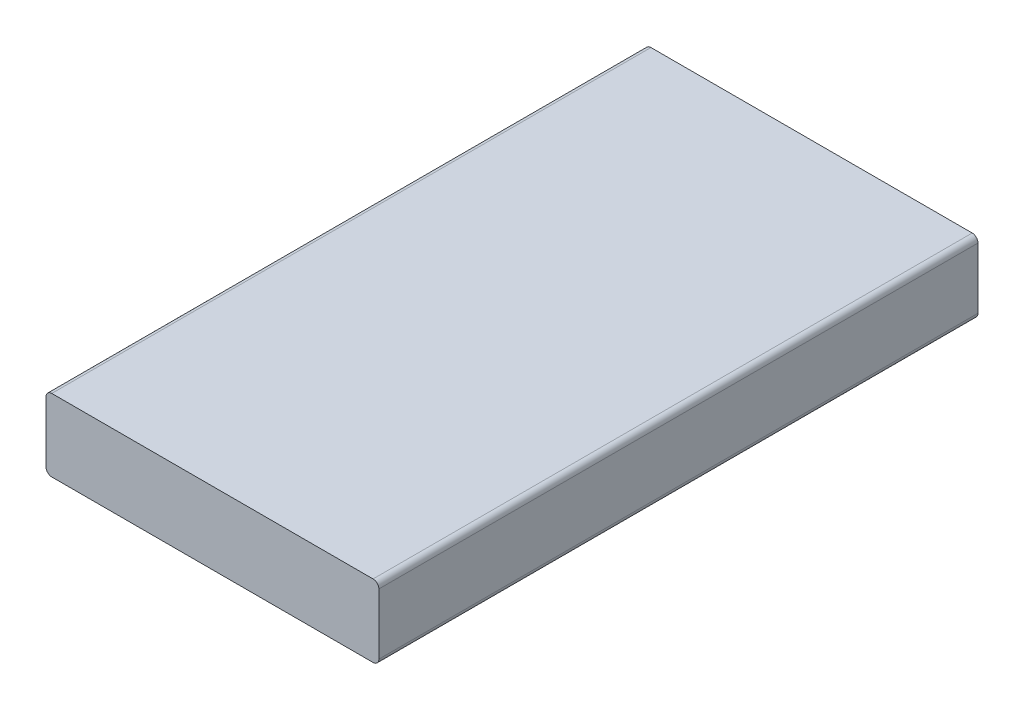
ISO-10303-21;
HEADER;
FILE_DESCRIPTION(('STEP AP214'),'2;1');
FILE_NAME('part.step','',(''),(''),'','','');
FILE_SCHEMA(('AUTOMOTIVE_DESIGN { 1 0 10303 214 1 1 1 1 }'));
ENDSEC;
DATA;
#1=APPLICATION_CONTEXT('core data for automotive mechanical design processes');
#2=APPLICATION_PROTOCOL_DEFINITION('international standard','automotive_design',2000,#1);
#3=PRODUCT_CONTEXT('',#1,'mechanical');
#4=PRODUCT('Part','Part','',(#3));
#5=PRODUCT_RELATED_PRODUCT_CATEGORY('part','',(#4));
#6=PRODUCT_DEFINITION_FORMATION('','',#4);
#7=PRODUCT_DEFINITION_CONTEXT('part definition',#1,'design');
#8=PRODUCT_DEFINITION('design','',#6,#7);
#9=PRODUCT_DEFINITION_SHAPE('','',#8);
#10=(LENGTH_UNIT() NAMED_UNIT(*) SI_UNIT(.MILLI.,.METRE.));
#11=(NAMED_UNIT(*) PLANE_ANGLE_UNIT() SI_UNIT($,.RADIAN.));
#12=(NAMED_UNIT(*) SI_UNIT($,.STERADIAN.) SOLID_ANGLE_UNIT());
#13=UNCERTAINTY_MEASURE_WITH_UNIT(LENGTH_MEASURE(1.E-05),#10,'distance_accuracy_value','');
#14=(GEOMETRIC_REPRESENTATION_CONTEXT(3) GLOBAL_UNCERTAINTY_ASSIGNED_CONTEXT((#13)) GLOBAL_UNIT_ASSIGNED_CONTEXT((#10,
#11,#12)) REPRESENTATION_CONTEXT('',''));
#15=CARTESIAN_POINT('',(0.,0.,0.));
#16=DIRECTION('',(0.,0.,1.));
#17=DIRECTION('',(1.,0.,0.));
#18=AXIS2_PLACEMENT_3D('',#15,#16,#17);
#19=CARTESIAN_POINT('',(-29.3402777777778,15.8854166666667,-207.));
#20=DIRECTION('',(-1.,0.,0.));
#21=DIRECTION('',(0.,0.,1.));
#22=AXIS2_PLACEMENT_3D('',#19,#20,#21);
#23=PLANE('',#22);
#24=DIRECTION('',(0.,-1.,0.));
#25=VECTOR('',#24,1.);
#26=CARTESIAN_POINT('',(-29.3402777777778,15.8854166666667,-207.));
#27=LINE('',#26,#25);
#28=CARTESIAN_POINT('',(-29.3402777777778,13.8854166666667,-207.));
#29=VERTEX_POINT('',#28);
#30=CARTESIAN_POINT('',(-29.3402777777778,-7.11458333333333,-207.));
#31=VERTEX_POINT('',#30);
#32=EDGE_CURVE('E179',#29,#31,#27,.T.);
#33=ORIENTED_EDGE('',*,*,#32,.T.);
#34=DIRECTION('',(0.,0.,1.));
#35=VECTOR('',#34,1.);
#36=CARTESIAN_POINT('',(-29.3402777777778,-7.11458333333333,-207.));
#37=LINE('',#36,#35);
#38=CARTESIAN_POINT('',(-29.3402777777778,-7.11458333333333,0.));
#39=VERTEX_POINT('',#38);
#40=EDGE_CURVE('E11',#31,#39,#37,.T.);
#41=ORIENTED_EDGE('',*,*,#40,.T.);
#42=DIRECTION('',(0.,-1.,0.));
#43=VECTOR('',#42,1.);
#44=CARTESIAN_POINT('',(-29.3402777777778,15.8854166666667,0.));
#45=LINE('',#44,#43);
#46=CARTESIAN_POINT('',(-29.3402777777778,13.8854166666667,0.));
#47=VERTEX_POINT('',#46);
#48=EDGE_CURVE('E112',#47,#39,#45,.T.);
#49=ORIENTED_EDGE('',*,*,#48,.F.);
#50=DIRECTION('',(0.,0.,1.));
#51=VECTOR('',#50,1.);
#52=CARTESIAN_POINT('',(-29.3402777777778,13.8854166666667,-207.));
#53=LINE('',#52,#51);
#54=EDGE_CURVE('E48',#47,#29,#53,.F.);
#55=ORIENTED_EDGE('',*,*,#54,.T.);
#56=EDGE_LOOP('',(#33,#41,#49,#55));
#57=FACE_BOUND('',#56,.T.);
#58=ADVANCED_FACE('F39',(#57),#23,.T.);
#59=CARTESIAN_POINT('',(-29.3402777777778,15.8854166666667,-207.));
#60=DIRECTION('',(0.,1.,0.));
#61=DIRECTION('',(0.,0.,1.));
#62=AXIS2_PLACEMENT_3D('',#59,#60,#61);
#63=PLANE('',#62);
#64=DIRECTION('',(-1.,0.,0.));
#65=VECTOR('',#64,1.);
#66=CARTESIAN_POINT('',(-29.3402777777778,15.8854166666667,0.));
#67=LINE('',#66,#65);
#68=CARTESIAN_POINT('',(83.6597222222222,15.8854166666667,0.));
#69=VERTEX_POINT('',#68);
#70=CARTESIAN_POINT('',(-27.3402777777778,15.8854166666667,0.));
#71=VERTEX_POINT('',#70);
#72=EDGE_CURVE('E143',#69,#71,#67,.T.);
#73=ORIENTED_EDGE('',*,*,#72,.F.);
#74=DIRECTION('',(0.,0.,1.));
#75=VECTOR('',#74,1.);
#76=CARTESIAN_POINT('',(83.6597222222222,15.8854166666667,-207.));
#77=LINE('',#76,#75);
#78=CARTESIAN_POINT('',(83.6597222222222,15.8854166666667,-207.));
#79=VERTEX_POINT('',#78);
#80=EDGE_CURVE('E62',#69,#79,#77,.F.);
#81=ORIENTED_EDGE('',*,*,#80,.T.);
#82=DIRECTION('',(-1.,0.,0.));
#83=VECTOR('',#82,1.);
#84=CARTESIAN_POINT('',(-29.3402777777778,15.8854166666667,-207.));
#85=LINE('',#84,#83);
#86=CARTESIAN_POINT('',(-27.3402777777778,15.8854166666667,-207.));
#87=VERTEX_POINT('',#86);
#88=EDGE_CURVE('E135',#79,#87,#85,.T.);
#89=ORIENTED_EDGE('',*,*,#88,.T.);
#90=DIRECTION('',(0.,0.,1.));
#91=VECTOR('',#90,1.);
#92=CARTESIAN_POINT('',(-27.3402777777778,15.8854166666667,-207.));
#93=LINE('',#92,#91);
#94=EDGE_CURVE('E170',#87,#71,#93,.T.);
#95=ORIENTED_EDGE('',*,*,#94,.T.);
#96=EDGE_LOOP('',(#73,#81,#89,#95));
#97=FACE_BOUND('',#96,.T.);
#98=ADVANCED_FACE('F188',(#97),#63,.T.);
#99=CARTESIAN_POINT('',(85.6597222222222,15.8854166666667,-207.));
#100=DIRECTION('',(1.,0.,0.));
#101=DIRECTION('',(0.,0.,-1.));
#102=AXIS2_PLACEMENT_3D('',#99,#100,#101);
#103=PLANE('',#102);
#104=DIRECTION('',(0.,1.,0.));
#105=VECTOR('',#104,1.);
#106=CARTESIAN_POINT('',(85.6597222222222,15.8854166666667,0.));
#107=LINE('',#106,#105);
#108=CARTESIAN_POINT('',(85.6597222222222,-7.11458333333333,0.));
#109=VERTEX_POINT('',#108);
#110=CARTESIAN_POINT('',(85.6597222222222,13.8854166666667,0.));
#111=VERTEX_POINT('',#110);
#112=EDGE_CURVE('E129',#109,#111,#107,.T.);
#113=ORIENTED_EDGE('',*,*,#112,.F.);
#114=DIRECTION('',(0.,0.,1.));
#115=VECTOR('',#114,1.);
#116=CARTESIAN_POINT('',(85.6597222222222,-7.11458333333333,-207.));
#117=LINE('',#116,#115);
#118=CARTESIAN_POINT('',(85.6597222222222,-7.11458333333333,-207.));
#119=VERTEX_POINT('',#118);
#120=EDGE_CURVE('E157',#109,#119,#117,.F.);
#121=ORIENTED_EDGE('',*,*,#120,.T.);
#122=DIRECTION('',(0.,1.,0.));
#123=VECTOR('',#122,1.);
#124=CARTESIAN_POINT('',(85.6597222222222,15.8854166666667,-207.));
#125=LINE('',#124,#123);
#126=CARTESIAN_POINT('',(85.6597222222222,13.8854166666667,-207.));
#127=VERTEX_POINT('',#126);
#128=EDGE_CURVE('E140',#119,#127,#125,.T.);
#129=ORIENTED_EDGE('',*,*,#128,.T.);
#130=DIRECTION('',(0.,0.,1.));
#131=VECTOR('',#130,1.);
#132=CARTESIAN_POINT('',(85.6597222222222,13.8854166666667,-207.));
#133=LINE('',#132,#131);
#134=EDGE_CURVE('E153',#127,#111,#133,.T.);
#135=ORIENTED_EDGE('',*,*,#134,.T.);
#136=EDGE_LOOP('',(#113,#121,#129,#135));
#137=FACE_BOUND('',#136,.T.);
#138=ADVANCED_FACE('F205',(#137),#103,.T.);
#139=CARTESIAN_POINT('',(-29.3402777777778,-9.11458333333333,-207.));
#140=DIRECTION('',(0.,-1.,0.));
#141=DIRECTION('',(0.,0.,-1.));
#142=AXIS2_PLACEMENT_3D('',#139,#140,#141);
#143=PLANE('',#142);
#144=DIRECTION('',(1.,0.,0.));
#145=VECTOR('',#144,1.);
#146=CARTESIAN_POINT('',(-29.3402777777778,-9.11458333333333,-207.));
#147=LINE('',#146,#145);
#148=CARTESIAN_POINT('',(-27.3402777777778,-9.11458333333333,-207.));
#149=VERTEX_POINT('',#148);
#150=CARTESIAN_POINT('',(83.6597222222222,-9.11458333333333,-207.));
#151=VERTEX_POINT('',#150);
#152=EDGE_CURVE('E184',#149,#151,#147,.T.);
#153=ORIENTED_EDGE('',*,*,#152,.T.);
#154=DIRECTION('',(0.,0.,1.));
#155=VECTOR('',#154,1.);
#156=CARTESIAN_POINT('',(83.6597222222222,-9.11458333333333,-207.));
#157=LINE('',#156,#155);
#158=CARTESIAN_POINT('',(83.6597222222222,-9.11458333333333,0.));
#159=VERTEX_POINT('',#158);
#160=EDGE_CURVE('E127',#151,#159,#157,.T.);
#161=ORIENTED_EDGE('',*,*,#160,.T.);
#162=DIRECTION('',(1.,0.,0.));
#163=VECTOR('',#162,1.);
#164=CARTESIAN_POINT('',(-29.3402777777778,-9.11458333333333,0.));
#165=LINE('',#164,#163);
#166=CARTESIAN_POINT('',(-27.3402777777778,-9.11458333333333,0.));
#167=VERTEX_POINT('',#166);
#168=EDGE_CURVE('E110',#167,#159,#165,.T.);
#169=ORIENTED_EDGE('',*,*,#168,.F.);
#170=DIRECTION('',(0.,0.,1.));
#171=VECTOR('',#170,1.);
#172=CARTESIAN_POINT('',(-27.3402777777778,-9.11458333333333,-207.));
#173=LINE('',#172,#171);
#174=EDGE_CURVE('E124',#167,#149,#173,.F.);
#175=ORIENTED_EDGE('',*,*,#174,.T.);
#176=EDGE_LOOP('',(#153,#161,#169,#175));
#177=FACE_BOUND('',#176,.T.);
#178=ADVANCED_FACE('F123',(#177),#143,.T.);
#179=CARTESIAN_POINT('',(0.,0.,-207.));
#180=DIRECTION('',(0.,0.,1.));
#181=DIRECTION('',(1.,0.,0.));
#182=AXIS2_PLACEMENT_3D('',#179,#180,#181);
#183=PLANE('',#182);
#184=ORIENTED_EDGE('',*,*,#128,.F.);
#185=CARTESIAN_POINT('',(83.6597222222222,-7.11458333333333,-207.));
#186=DIRECTION('',(0.,0.,1.));
#187=DIRECTION('',(1.,0.,0.));
#188=AXIS2_PLACEMENT_3D('',#185,#186,#187);
#189=CIRCLE('',#188,2.);
#190=EDGE_CURVE('E167',#119,#151,#189,.F.);
#191=ORIENTED_EDGE('',*,*,#190,.T.);
#192=ORIENTED_EDGE('',*,*,#152,.F.);
#193=CARTESIAN_POINT('',(-27.3402777777778,-7.11458333333333,-207.));
#194=DIRECTION('',(0.,0.,1.));
#195=DIRECTION('',(1.,0.,0.));
#196=AXIS2_PLACEMENT_3D('',#193,#194,#195);
#197=CIRCLE('',#196,2.);
#198=EDGE_CURVE('E133',#149,#31,#197,.F.);
#199=ORIENTED_EDGE('',*,*,#198,.T.);
#200=ORIENTED_EDGE('',*,*,#32,.F.);
#201=CARTESIAN_POINT('',(-27.3402777777778,13.8854166666667,-207.));
#202=DIRECTION('',(0.,0.,1.));
#203=DIRECTION('',(1.,0.,0.));
#204=AXIS2_PLACEMENT_3D('',#201,#202,#203);
#205=CIRCLE('',#204,2.);
#206=EDGE_CURVE('E55',#29,#87,#205,.F.);
#207=ORIENTED_EDGE('',*,*,#206,.T.);
#208=ORIENTED_EDGE('',*,*,#88,.F.);
#209=CARTESIAN_POINT('',(83.6597222222222,13.8854166666667,-207.));
#210=DIRECTION('',(0.,0.,1.));
#211=DIRECTION('',(1.,0.,0.));
#212=AXIS2_PLACEMENT_3D('',#209,#210,#211);
#213=CIRCLE('',#212,2.);
#214=EDGE_CURVE('E164',#79,#127,#213,.F.);
#215=ORIENTED_EDGE('',*,*,#214,.T.);
#216=EDGE_LOOP('',(#184,#191,#192,#199,#200,#207,#208,#215));
#217=FACE_BOUND('',#216,.T.);
#218=ADVANCED_FACE('F182',(#217),#183,.F.);
#219=CARTESIAN_POINT('',(0.,0.,0.));
#220=DIRECTION('',(0.,0.,1.));
#221=DIRECTION('',(1.,0.,0.));
#222=AXIS2_PLACEMENT_3D('',#219,#220,#221);
#223=PLANE('',#222);
#224=ORIENTED_EDGE('',*,*,#168,.T.);
#225=CARTESIAN_POINT('',(83.6597222222222,-7.11458333333333,0.));
#226=DIRECTION('',(0.,0.,1.));
#227=DIRECTION('',(1.,0.,0.));
#228=AXIS2_PLACEMENT_3D('',#225,#226,#227);
#229=CIRCLE('',#228,2.);
#230=EDGE_CURVE('E150',#159,#109,#229,.T.);
#231=ORIENTED_EDGE('',*,*,#230,.T.);
#232=ORIENTED_EDGE('',*,*,#112,.T.);
#233=CARTESIAN_POINT('',(83.6597222222222,13.8854166666667,0.));
#234=DIRECTION('',(0.,0.,1.));
#235=DIRECTION('',(1.,0.,0.));
#236=AXIS2_PLACEMENT_3D('',#233,#234,#235);
#237=CIRCLE('',#236,2.);
#238=EDGE_CURVE('E117',#111,#69,#237,.T.);
#239=ORIENTED_EDGE('',*,*,#238,.T.);
#240=ORIENTED_EDGE('',*,*,#72,.T.);
#241=CARTESIAN_POINT('',(-27.3402777777778,13.8854166666667,0.));
#242=DIRECTION('',(0.,0.,1.));
#243=DIRECTION('',(1.,0.,0.));
#244=AXIS2_PLACEMENT_3D('',#241,#242,#243);
#245=CIRCLE('',#244,2.);
#246=EDGE_CURVE('E118',#71,#47,#245,.T.);
#247=ORIENTED_EDGE('',*,*,#246,.T.);
#248=ORIENTED_EDGE('',*,*,#48,.T.);
#249=CARTESIAN_POINT('',(-27.3402777777778,-7.11458333333333,0.));
#250=DIRECTION('',(0.,0.,1.));
#251=DIRECTION('',(1.,0.,0.));
#252=AXIS2_PLACEMENT_3D('',#249,#250,#251);
#253=CIRCLE('',#252,2.);
#254=EDGE_CURVE('E107',#39,#167,#253,.T.);
#255=ORIENTED_EDGE('',*,*,#254,.T.);
#256=EDGE_LOOP('',(#224,#231,#232,#239,#240,#247,#248,#255));
#257=FACE_BOUND('',#256,.T.);
#258=ADVANCED_FACE('F109',(#257),#223,.T.);
#259=CARTESIAN_POINT('',(83.6597222222222,-7.11458333333333,-207.));
#260=DIRECTION('',(0.,0.,1.));
#261=DIRECTION('',(1.,0.,0.));
#262=AXIS2_PLACEMENT_3D('',#259,#260,#261);
#263=CYLINDRICAL_SURFACE('',#262,2.);
#264=ORIENTED_EDGE('',*,*,#190,.F.);
#265=ORIENTED_EDGE('',*,*,#120,.F.);
#266=ORIENTED_EDGE('',*,*,#230,.F.);
#267=ORIENTED_EDGE('',*,*,#160,.F.);
#268=EDGE_LOOP('',(#264,#265,#266,#267));
#269=FACE_BOUND('',#268,.T.);
#270=ADVANCED_FACE('F202',(#269),#263,.T.);
#271=CARTESIAN_POINT('',(83.6597222222222,13.8854166666667,-207.));
#272=DIRECTION('',(0.,0.,1.));
#273=DIRECTION('',(1.,0.,0.));
#274=AXIS2_PLACEMENT_3D('',#271,#272,#273);
#275=CYLINDRICAL_SURFACE('',#274,2.);
#276=ORIENTED_EDGE('',*,*,#214,.F.);
#277=ORIENTED_EDGE('',*,*,#80,.F.);
#278=ORIENTED_EDGE('',*,*,#238,.F.);
#279=ORIENTED_EDGE('',*,*,#134,.F.);
#280=EDGE_LOOP('',(#276,#277,#278,#279));
#281=FACE_BOUND('',#280,.T.);
#282=ADVANCED_FACE('F209',(#281),#275,.T.);
#283=CARTESIAN_POINT('',(-27.3402777777778,-7.11458333333333,-207.));
#284=DIRECTION('',(0.,0.,1.));
#285=DIRECTION('',(1.,0.,0.));
#286=AXIS2_PLACEMENT_3D('',#283,#284,#285);
#287=CYLINDRICAL_SURFACE('',#286,2.);
#288=ORIENTED_EDGE('',*,*,#198,.F.);
#289=ORIENTED_EDGE('',*,*,#174,.F.);
#290=ORIENTED_EDGE('',*,*,#254,.F.);
#291=ORIENTED_EDGE('',*,*,#40,.F.);
#292=EDGE_LOOP('',(#288,#289,#290,#291));
#293=FACE_BOUND('',#292,.T.);
#294=ADVANCED_FACE('F132',(#293),#287,.T.);
#295=CARTESIAN_POINT('',(-27.3402777777778,13.8854166666667,-207.));
#296=DIRECTION('',(0.,0.,1.));
#297=DIRECTION('',(1.,0.,0.));
#298=AXIS2_PLACEMENT_3D('',#295,#296,#297);
#299=CYLINDRICAL_SURFACE('',#298,2.);
#300=ORIENTED_EDGE('',*,*,#206,.F.);
#301=ORIENTED_EDGE('',*,*,#54,.F.);
#302=ORIENTED_EDGE('',*,*,#246,.F.);
#303=ORIENTED_EDGE('',*,*,#94,.F.);
#304=EDGE_LOOP('',(#300,#301,#302,#303));
#305=FACE_BOUND('',#304,.T.);
#306=ADVANCED_FACE('F41',(#305),#299,.T.);
#307=CLOSED_SHELL('',(#58,#98,#138,#178,#218,#258,#270,#282,#294,#306));
#308=MANIFOLD_SOLID_BREP('B2',#307);
#309=ADVANCED_BREP_SHAPE_REPRESENTATION('',(#18,#308),#14);
#310=SHAPE_DEFINITION_REPRESENTATION(#9,#309);
ENDSEC;
END-ISO-10303-21;
